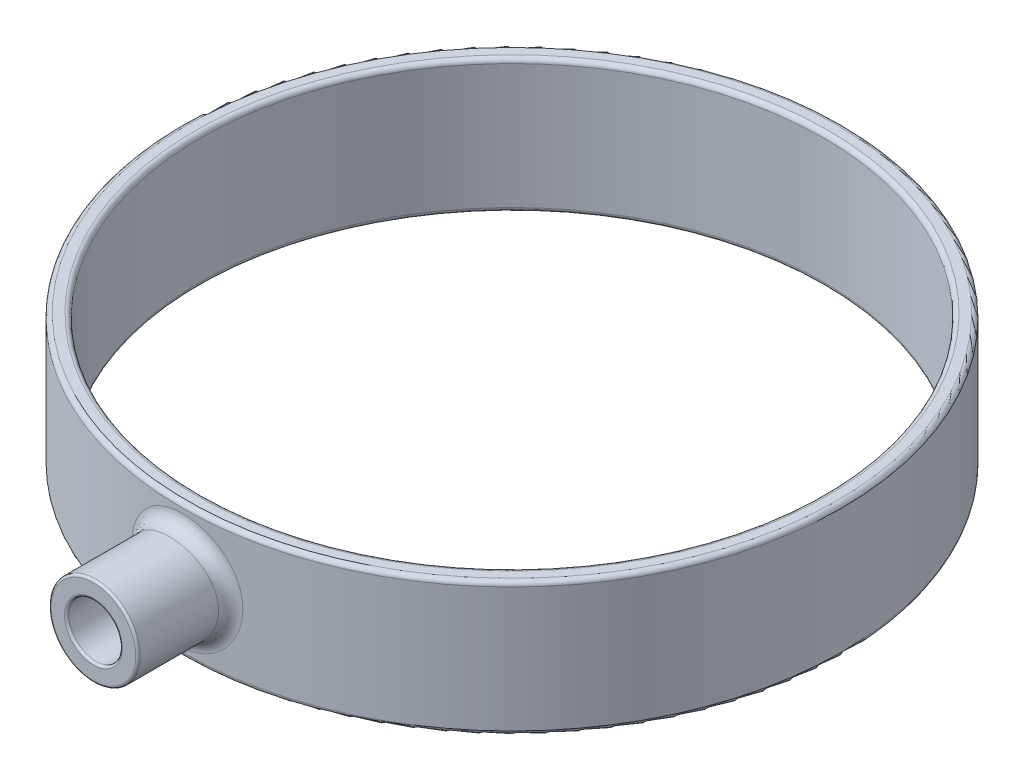
ISO-10303-21;
HEADER;
FILE_DESCRIPTION(('STEP AP214'),'2;1');
FILE_NAME('part.step','',(''),(''),'','','');
FILE_SCHEMA(('AUTOMOTIVE_DESIGN { 1 0 10303 214 1 1 1 1 }'));
ENDSEC;
DATA;
#1=APPLICATION_CONTEXT('core data for automotive mechanical design processes');
#2=APPLICATION_PROTOCOL_DEFINITION('international standard','automotive_design',2000,#1);
#3=PRODUCT_CONTEXT('',#1,'mechanical');
#4=PRODUCT('Part','Part','',(#3));
#5=PRODUCT_RELATED_PRODUCT_CATEGORY('part','',(#4));
#6=PRODUCT_DEFINITION_FORMATION('','',#4);
#7=PRODUCT_DEFINITION_CONTEXT('part definition',#1,'design');
#8=PRODUCT_DEFINITION('design','',#6,#7);
#9=PRODUCT_DEFINITION_SHAPE('','',#8);
#10=(LENGTH_UNIT() NAMED_UNIT(*) SI_UNIT(.MILLI.,.METRE.));
#11=(NAMED_UNIT(*) PLANE_ANGLE_UNIT() SI_UNIT($,.RADIAN.));
#12=(NAMED_UNIT(*) SI_UNIT($,.STERADIAN.) SOLID_ANGLE_UNIT());
#13=UNCERTAINTY_MEASURE_WITH_UNIT(LENGTH_MEASURE(1.E-05),#10,'distance_accuracy_value','');
#14=(GEOMETRIC_REPRESENTATION_CONTEXT(3) GLOBAL_UNCERTAINTY_ASSIGNED_CONTEXT((#13)) GLOBAL_UNIT_ASSIGNED_CONTEXT((#10,
#11,#12)) REPRESENTATION_CONTEXT('',''));
#15=CARTESIAN_POINT('',(0.,0.,0.));
#16=DIRECTION('',(0.,0.,1.));
#17=DIRECTION('',(1.,0.,0.));
#18=AXIS2_PLACEMENT_3D('',#15,#16,#17);
#19=CARTESIAN_POINT('',(0.,15.2591186440678,0.));
#20=DIRECTION('',(0.,1.,0.));
#21=DIRECTION('',(0.,0.,1.));
#22=AXIS2_PLACEMENT_3D('',#19,#20,#21);
#23=CYLINDRICAL_SURFACE('',#22,35.);
#24=CARTESIAN_POINT('',(0.,-6.99999999999999,0.));
#25=DIRECTION('',(0.,1.,0.));
#26=DIRECTION('',(0.,0.,1.));
#27=AXIS2_PLACEMENT_3D('',#24,#25,#26);
#28=CIRCLE('',#27,35.);
#29=CARTESIAN_POINT('',(0.,-6.99999999999999,35.));
#30=VERTEX_POINT('',#29);
#31=EDGE_CURVE('E52',#30,#30,#28,.F.);
#32=ORIENTED_EDGE('',*,*,#31,.T.);
#33=EDGE_LOOP('',(#32));
#34=FACE_BOUND('',#33,.T.);
#35=CARTESIAN_POINT('',(0.,7.00000000000001,0.));
#36=DIRECTION('',(0.,-1.,0.));
#37=DIRECTION('',(0.,0.,-1.));
#38=AXIS2_PLACEMENT_3D('',#35,#36,#37);
#39=CIRCLE('',#38,35.);
#40=CARTESIAN_POINT('',(0.,7.00000000000001,-35.));
#41=VERTEX_POINT('',#40);
#42=EDGE_CURVE('E55',#41,#41,#39,.F.);
#43=ORIENTED_EDGE('',*,*,#42,.T.);
#44=EDGE_LOOP('',(#43));
#45=FACE_BOUND('',#44,.T.);
#46=ADVANCED_FACE('F32',(#34,#45),#23,.F.);
#47=CARTESIAN_POINT('',(35.,-7.49999999999999,0.));
#48=DIRECTION('',(0.,1.,0.));
#49=DIRECTION('',(0.,0.,1.));
#50=AXIS2_PLACEMENT_3D('',#47,#48,#49);
#51=PLANE('',#50);
#52=CARTESIAN_POINT('',(0.,-7.49999999999999,0.));
#53=DIRECTION('',(0.,1.,0.));
#54=DIRECTION('',(0.,0.,1.));
#55=AXIS2_PLACEMENT_3D('',#52,#53,#54);
#56=CIRCLE('',#55,35.5);
#57=CARTESIAN_POINT('',(0.,-7.49999999999999,35.5));
#58=VERTEX_POINT('',#57);
#59=EDGE_CURVE('E58',#58,#58,#56,.T.);
#60=ORIENTED_EDGE('',*,*,#59,.T.);
#61=EDGE_LOOP('',(#60));
#62=FACE_BOUND('',#61,.T.);
#63=CARTESIAN_POINT('',(0.,-7.49999999999999,0.));
#64=DIRECTION('',(0.,1.,0.));
#65=DIRECTION('',(0.,0.,1.));
#66=AXIS2_PLACEMENT_3D('',#63,#64,#65);
#67=CIRCLE('',#66,36.5);
#68=CARTESIAN_POINT('',(0.,-7.49999999999999,36.5));
#69=VERTEX_POINT('',#68);
#70=EDGE_CURVE('E61',#69,#69,#67,.F.);
#71=ORIENTED_EDGE('',*,*,#70,.T.);
#72=EDGE_LOOP('',(#71));
#73=FACE_BOUND('',#72,.T.);
#74=ADVANCED_FACE('F100',(#62,#73),#51,.F.);
#75=CARTESIAN_POINT('',(0.,15.2591186440678,0.));
#76=DIRECTION('',(0.,1.,0.));
#77=DIRECTION('',(0.,0.,1.));
#78=AXIS2_PLACEMENT_3D('',#75,#76,#77);
#79=CYLINDRICAL_SURFACE('',#78,37.);
#80=CARTESIAN_POINT('',(0.,-6.99999999999999,0.));
#81=DIRECTION('',(0.,1.,0.));
#82=DIRECTION('',(0.,0.,1.));
#83=AXIS2_PLACEMENT_3D('',#80,#81,#82);
#84=CIRCLE('',#83,37.);
#85=CARTESIAN_POINT('',(0.,-6.99999999999999,37.));
#86=VERTEX_POINT('',#85);
#87=EDGE_CURVE('E43',#86,#86,#84,.T.);
#88=ORIENTED_EDGE('',*,*,#87,.T.);
#89=EDGE_LOOP('',(#88));
#90=FACE_BOUND('',#89,.T.);
#91=CARTESIAN_POINT('',(0.,7.00000000000001,0.));
#92=DIRECTION('',(0.,-1.,0.));
#93=DIRECTION('',(0.,0.,-1.));
#94=AXIS2_PLACEMENT_3D('',#91,#92,#93);
#95=CIRCLE('',#94,37.);
#96=CARTESIAN_POINT('',(0.,7.00000000000001,-37.));
#97=VERTEX_POINT('',#96);
#98=EDGE_CURVE('E47',#97,#97,#95,.T.);
#99=ORIENTED_EDGE('',*,*,#98,.T.);
#100=EDGE_LOOP('',(#99));
#101=FACE_BOUND('',#100,.T.);
#102=CARTESIAN_POINT('',(4.86471091963291,-1.15524355371684,37.9770384990668));
#103=CARTESIAN_POINT('',(4.85337000618559,-1.20299994699709,36.7013000592004));
#104=CARTESIAN_POINT('',(6.07772974634657,-1.5018166198319,36.4974136224798));
#105=CARTESIAN_POINT('',(4.92945723035187,-0.882597477970086,37.9630230238699));
#106=CARTESIAN_POINT('',(4.92322775678545,-0.920703679792843,36.6924520052298));
#107=CARTESIAN_POINT('',(6.15862059165748,-1.14737672136071,36.4839442046073));
#108=CARTESIAN_POINT('',(4.97125706409363,-0.604355888256829,37.9537205270873));
#109=CARTESIAN_POINT('',(4.96876757215891,-0.630508024680443,36.6864982257155));
#110=CARTESIAN_POINT('',(6.21084324091832,-0.785662654733737,36.4750041417682));
#111=CARTESIAN_POINT('',(5.00765560028706,-0.0447219485892453,37.9456338891884));
#112=CARTESIAN_POINT('',(5.00830143792854,-0.0469014298190285,36.6813398685768));
#113=CARTESIAN_POINT('',(6.25631777575035,-0.0581385331662,36.4672325676991));
#114=CARTESIAN_POINT('',(5.00225770411468,0.236670172857591,37.9468489901054));
#115=CARTESIAN_POINT('',(5.00240722003136,0.247301969050445,36.6821206858632));
#116=CARTESIAN_POINT('',(6.24957391083279,0.307671224714626,36.4684003280334));
#117=CARTESIAN_POINT('',(4.94475425601912,0.791416363644054,37.9595819108153));
#118=CARTESIAN_POINT('',(4.93999023934826,0.82540992663859,36.690233759774));
#119=CARTESIAN_POINT('',(6.17773194065881,1.02884127273751,36.4806371611618));
#120=CARTESIAN_POINT('',(4.89315211423498,1.06482435243964,37.9709886861695));
#121=CARTESIAN_POINT('',(4.88384765890611,1.11014961979795,36.6975168664247));
#122=CARTESIAN_POINT('',(6.11326277118969,1.38427165817231,36.4915995159432));
#123=CARTESIAN_POINT('',(4.74551035439131,1.59904235149792,38.002641964539));
#124=CARTESIAN_POINT('',(4.7245379937294,1.66321910105624,36.7174742781041));
#125=CARTESIAN_POINT('',(5.92880644263465,2.07875505694796,36.522019549573));
#126=CARTESIAN_POINT('',(4.64946929726731,1.85985195348523,38.0228887538191));
#127=CARTESIAN_POINT('',(4.62098510456638,1.93213261240496,36.7301948125226));
#128=CARTESIAN_POINT('',(5.80881748565262,2.41780753953081,36.5414775035331));
#129=CARTESIAN_POINT('',(4.4152210829074,2.36287110267105,38.0700481431573));
#130=CARTESIAN_POINT('',(4.37102435451885,2.44654090257071,36.7593460207483));
#131=CARTESIAN_POINT('',(5.51615932698135,3.07173243347235,36.586799514341));
#132=CARTESIAN_POINT('',(4.27682056712336,2.60498884477747,38.0969912014486));
#133=CARTESIAN_POINT('',(4.22392170895632,2.69223267878121,36.7758434984908));
#134=CARTESIAN_POINT('',(5.34324855266376,3.38648549821133,36.612692842733));
#135=CARTESIAN_POINT('',(3.96191401154341,3.06274902358894,38.1544894193196));
#136=CARTESIAN_POINT('',(3.89324933316868,3.15213068929333,36.8103820165402));
#137=CARTESIAN_POINT('',(4.94981984294872,3.98157373066618,36.6679508702046));
#138=CARTESIAN_POINT('',(3.78540478620487,3.27838924464794,38.1850448807668));
#139=CARTESIAN_POINT('',(3.70920426083321,3.36633967239603,36.8284545628467));
#140=CARTESIAN_POINT('',(4.72929792769153,4.2619060180422,36.6973158593909));
#141=CARTESIAN_POINT('',(3.39661008962417,3.67996362844022,38.2468041474585));
#142=CARTESIAN_POINT('',(3.30905456269161,3.76095318999368,36.8642393087673));
#143=CARTESIAN_POINT('',(4.24355702107162,4.78395271697241,36.7566689209821));
#144=CARTESIAN_POINT('',(3.18389654358005,3.86548328422251,38.2780112493025));
#145=CARTESIAN_POINT('',(3.09228469961183,3.94058567772731,36.881940548127));
#146=CARTESIAN_POINT('',(3.97780321417637,5.02512826949033,36.7866601615421));
#147=CARTESIAN_POINT('',(2.73015019465978,4.19826591685627,38.337200337788));
#148=CARTESIAN_POINT('',(2.63589524490729,4.25941238457704,36.9148409897236));
#149=CARTESIAN_POINT('',(3.41091491850603,5.45774569191384,36.843543181608));
#150=CARTESIAN_POINT('',(2.48911716645012,4.34552858927321,38.365182298764));
#151=CARTESIAN_POINT('',(2.3962619908469,4.39812910606802,36.930005346586));
#152=CARTESIAN_POINT('',(3.10978014821036,5.64918716605454,36.8704349364484));
#153=CARTESIAN_POINT('',(1.98509654015797,4.59770414817214,38.4148189100136));
#154=CARTESIAN_POINT('',(1.90080196527733,4.63368460079975,36.9564625044231));
#155=CARTESIAN_POINT('',(2.48008165147404,5.97701539262441,36.9181376538055));
#156=CARTESIAN_POINT('',(1.72208334709135,4.70256680852917,38.4364660478619));
#157=CARTESIAN_POINT('',(1.64528756630519,4.72994773261604,36.9676978193883));
#158=CARTESIAN_POINT('',(2.15148594792332,6.11333685109111,36.9389413965884));
#159=CARTESIAN_POINT('',(1.18183306264162,4.8665120127487,38.4709372724457));
#160=CARTESIAN_POINT('',(1.12448096619732,4.87981942618282,36.9854204833059));
#161=CARTESIAN_POINT('',(1.47652390423165,6.32646561657659,36.9720695864255));
#162=CARTESIAN_POINT('',(0.90459716321574,4.92559838630713,38.483762097256));
#163=CARTESIAN_POINT('',(0.859824927558605,4.93301022537734,36.9918599589387));
#164=CARTESIAN_POINT('',(1.13015905326325,6.40327790220007,36.9843947427982));
#165=CARTESIAN_POINT('',(0.347322412949161,4.9957275675175,38.4990364871516));
#166=CARTESIAN_POINT('',(0.32922274120454,4.99624476121676,36.9995332973664));
#167=CARTESIAN_POINT('',(0.433927482153149,6.49444583777197,36.9990740266323));
#168=CARTESIAN_POINT('',(0.0673567137420761,5.00733638634058,38.5016082760479));
#169=CARTESIAN_POINT('',(0.0641290562097716,5.00660196299893,37.0008049091509));
#170=CARTESIAN_POINT('',(0.0841521540524478,6.50953730224282,37.001545615939));
#171=CARTESIAN_POINT('',(-0.490524166492074,4.98370606714712,38.496426572443));
#172=CARTESIAN_POINT('',(-0.4656970954445,4.9853548513288,36.9982142200999));
#173=CARTESIAN_POINT('',(-0.612836685929706,6.47881788729141,36.9965657968935));
#174=CARTESIAN_POINT('',(-0.768439430469086,4.94846883484401,38.4886734999606));
#175=CARTESIAN_POINT('',(-0.729589027527958,4.95381934501874,36.9943603236358));
#176=CARTESIAN_POINT('',(-0.960050301444727,6.4330094852966,36.9891147921958));
#177=CARTESIAN_POINT('',(-1.3124867651498,4.8326225804137,38.4637915359862));
#178=CARTESIAN_POINT('',(-1.25024670663373,4.84876821568362,36.981740519611));
#179=CARTESIAN_POINT('',(-1.63975619230252,6.28240935453842,36.9652022553377));
#180=CARTESIAN_POINT('',(-1.57868337290135,4.75230821708441,38.4467235537254));
#181=CARTESIAN_POINT('',(-1.50632878908045,4.77583202384171,36.9730428864624));
#182=CARTESIAN_POINT('',(-1.97232909704794,6.17800068221233,36.9487992593223));
#183=CARTESIAN_POINT('',(-2.09382206595468,4.54891233734191,38.4051239807591));
#184=CARTESIAN_POINT('',(-2.00727285622883,4.58809888698969,36.951307570593));
#185=CARTESIAN_POINT('',(-2.61591795771994,5.91358603854698,36.9088204489401));
#186=CARTESIAN_POINT('',(-2.34276364764969,4.4258295733161,38.3805921723262));
#187=CARTESIAN_POINT('',(-2.25166393775665,4.4737628382773,36.9383201221727));
#188=CARTESIAN_POINT('',(-2.92693328446505,5.75357844531135,36.8852444253287));
#189=CARTESIAN_POINT('',(-2.81874244260166,4.13914916772287,38.3264901226893));
#190=CARTESIAN_POINT('',(-2.72444126514171,4.20288811259775,36.9089276041702));
#191=CARTESIAN_POINT('',(-3.52159770101781,5.38089391803931,36.8332502478032));
#192=CARTESIAN_POINT('',(-3.04556866224729,3.97520604898105,38.2968776258939));
#193=CARTESIAN_POINT('',(-2.95252072556793,4.04648474105914,36.8925381316393));
#194=CARTESIAN_POINT('',(-3.80498318582009,5.16776786367619,36.8047914846184));
#195=CARTESIAN_POINT('',(-3.46873662897258,3.61187682765904,38.2360098604349));
#196=CARTESIAN_POINT('',(-3.38268520085637,3.69429919538719,36.8580483603847));
#197=CARTESIAN_POINT('',(-4.3336683598331,4.69543987595795,36.746295190533));
#198=CARTESIAN_POINT('',(-3.66507052154777,3.41248162126748,38.2047541712682));
#199=CARTESIAN_POINT('',(-3.58491848188572,3.49890257382598,36.8399678886891));
#200=CARTESIAN_POINT('',(-4.57895823601359,4.43622610764804,36.7162572555126));
#201=CARTESIAN_POINT('',(-4.0238581121251,2.98129555526313,38.1437091138023));
#202=CARTESIAN_POINT('',(-3.95767605725251,3.07076546307586,36.8039904544421));
#203=CARTESIAN_POINT('',(-5.02720974527639,3.87568422184174,36.6575905768928));
#204=CARTESIAN_POINT('',(-4.18590884197933,2.74916769261151,38.1139400257427));
#205=CARTESIAN_POINT('',(-4.12824786235943,2.83777500621793,36.7860812853365));
#206=CARTESIAN_POINT('',(-5.22966792984137,3.57391800039488,36.6289813233931));
#207=CARTESIAN_POINT('',(-4.4685890022098,2.26078912137746,38.0596671947167));
#208=CARTESIAN_POINT('',(-4.42748091127424,2.3427212555236,36.7530079129246));
#209=CARTESIAN_POINT('',(-5.5828345716001,2.93902585779078,36.576823018347));
#210=CARTESIAN_POINT('',(-4.58925741924721,2.00456140916027,38.0351585040726));
#211=CARTESIAN_POINT('',(-4.55670883556228,2.08052870380113,36.7377965767624));
#212=CARTESIAN_POINT('',(-5.7335917368043,2.60592983190836,36.5532692118895));
#213=CARTESIAN_POINT('',(-4.7583566577734,1.54906051194178,37.9999171871221));
#214=CARTESIAN_POINT('',(-4.73838577055043,1.61127801801397,36.7157605947015));
#215=CARTESIAN_POINT('',(-5.94485598020917,2.01377866552431,36.519400932946));
#216=CARTESIAN_POINT('',(-4.81754605807879,1.35379435811287,37.9872488830442));
#217=CARTESIAN_POINT('',(-4.80231676470593,1.40923569439618,36.7077675168164));
#218=CARTESIAN_POINT('',(-6.01880429586584,1.75993266554677,36.5072261988585));
#219=CARTESIAN_POINT('',(-4.91171739081881,0.957359626806678,37.9668624044574));
#220=CARTESIAN_POINT('',(-4.90411625672732,0.998004434169409,36.6948714917423));
#221=CARTESIAN_POINT('',(-6.13645731157502,1.24456751484873,36.4876339986596));
#222=CARTESIAN_POINT('',(-4.94669981717313,0.756191169847438,37.9591441289482));
#223=CARTESIAN_POINT('',(-4.94212104158613,0.788566432431072,36.6899518467281));
#224=CARTESIAN_POINT('',(-6.18016262870642,0.983048520801691,36.480216435483));
#225=CARTESIAN_POINT('',(-5.00001309035365,0.277398095690273,37.9473548765447));
#226=CARTESIAN_POINT('',(-4.99995466813792,0.289799800022275,36.6824458501982));
#227=CARTESIAN_POINT('',(-6.24676960122445,0.360617524397326,36.4688865049077));
#228=CARTESIAN_POINT('',(-5.00771396836284,-0.00151226940761473,37.9456195846297));
#229=CARTESIAN_POINT('',(-5.00836796999471,-0.00178071623625106,36.6813301441002));
#230=CARTESIAN_POINT('',(-6.25639069814282,-0.00196595022995377,36.4672188216291));
#231=CARTESIAN_POINT('',(-4.97668714736008,-0.556819644280988,37.9525149834268));
#232=CARTESIAN_POINT('',(-4.97466871717278,-0.58094021566909,36.6857288723265));
#233=CARTESIAN_POINT('',(-6.21762731916295,-0.72386553756523,36.4738455684511));
#234=CARTESIAN_POINT('',(-4.93792031648918,-0.833214337919557,37.9611544110143));
#235=CARTESIAN_POINT('',(-4.93242275616096,-0.869292612760622,36.6912607810904));
#236=CARTESIAN_POINT('',(-6.16919395385136,-1.08317863929523,36.4821483950295));
#237=CARTESIAN_POINT('',(-4.81515548019795,-1.37529478981959,37.9877955239181));
#238=CARTESIAN_POINT('',(-4.79966155317507,-1.43187647208948,36.7081242149874));
#239=CARTESIAN_POINT('',(-6.01581762590581,-1.78788322676565,36.507751542438));
#240=CARTESIAN_POINT('',(-4.73118853221662,-1.64098776676063,38.0057907804636));
#241=CARTESIAN_POINT('',(-4.70884610874487,-1.70676636990218,36.7194929414676));
#242=CARTESIAN_POINT('',(-5.91091346490346,-2.13328409678953,36.525045684969));
#243=CARTESIAN_POINT('',(-4.52055571491639,-2.15443426278992,38.0490896417671));
#244=CARTESIAN_POINT('',(-4.48327066383743,-2.233938732107,36.7464307703508));
#245=CARTESIAN_POINT('',(-5.64775921783887,-2.80076454162756,36.5666575776844));
#246=CARTESIAN_POINT('',(-4.39389406855062,-2.40218955316032,38.0743925236888));
#247=CARTESIAN_POINT('',(-4.34803364863304,-2.48662360583093,36.7620508824111));
#248=CARTESIAN_POINT('',(-5.48951440772585,-3.12284641910852,36.590974633195));
#249=CARTESIAN_POINT('',(-4.10040330686644,-2.87482818265822,38.1296840171741));
#250=CARTESIAN_POINT('',(-4.03830524843744,-2.96409342767591,36.7955608506092));
#251=CARTESIAN_POINT('',(-5.12284153402893,-3.73727663745559,36.644111912569));
#252=CARTESIAN_POINT('',(-3.93328705821417,-3.09953089688654,38.1597055605837));
#253=CARTESIAN_POINT('',(-3.86304068779189,-3.1887421951214,36.8135046569002));
#254=CARTESIAN_POINT('',(-4.91405474022754,-4.02939016595278,36.6729637852166));
#255=CARTESIAN_POINT('',(-3.5640060756245,-3.51791541322736,38.2209602308402));
#256=CARTESIAN_POINT('',(-3.48074585250328,-3.60253823054198,36.8493739626674));
#257=CARTESIAN_POINT('',(-4.45269330483446,-4.57329003719557,36.7318319098748));
#258=CARTESIAN_POINT('',(-3.36183832720166,-3.71159454450329,38.2521934617146));
#259=CARTESIAN_POINT('',(-3.27334855436552,-3.79147477266841,36.8673078095416));
#260=CARTESIAN_POINT('',(-4.20011489709344,-4.82507290785364,36.76184826186));
#261=CARTESIAN_POINT('',(-2.92565276019271,-4.064488283097,38.3127463338812));
#262=CARTESIAN_POINT('',(-2.83171014877678,-4.13204538707337,36.901371668317));
#263=CARTESIAN_POINT('',(-3.65516617572922,-5.28383476802674,36.8200419313105));
#264=CARTESIAN_POINT('',(-2.69132371126091,-4.22332092446939,38.3420425233344));
#265=CARTESIAN_POINT('',(-2.59712581557742,-4.28281520179118,36.9174527461847));
#266=CARTESIAN_POINT('',(-3.3624070262711,-5.49031720181281,36.8481967106408));
#267=CARTESIAN_POINT('',(-2.19896309475519,-4.49935612764256,38.39506590877));
#268=CARTESIAN_POINT('',(-2.11011694625105,-4.54243133658752,36.9460390198583));
#269=CARTESIAN_POINT('',(-2.74727597031962,-5.84916296593771,36.8991542498524));
#270=CARTESIAN_POINT('',(-1.94093231914598,-4.61656007977956,38.4187932907333));
#271=CARTESIAN_POINT('',(-1.85792776450258,-4.65074903105855,36.9584941632109));
#272=CARTESIAN_POINT('',(-2.42490505326789,-6.00152810371363,36.9219571884685));
#273=CARTESIAN_POINT('',(-1.40974701199838,-4.80537973929687,38.4579020463906));
#274=CARTESIAN_POINT('',(-1.34338111408744,-4.82428278346825,36.9787821551331));
#275=CARTESIAN_POINT('',(-1.7612683448631,-6.24699366108573,36.9595422264297));
#276=CARTESIAN_POINT('',(-1.13667198260595,-4.87721400051798,38.4733233780341));
#277=CARTESIAN_POINT('',(-1.08162591200339,-4.88924783853191,36.9865860876097));
#278=CARTESIAN_POINT('',(-1.42010187956776,-6.34037820067492,36.9743627269219));
#279=CARTESIAN_POINT('',(-0.582121924722694,-4.97396600528119,38.4942497505626));
#280=CARTESIAN_POINT('',(-0.552255838057005,-4.97673949769498,36.9971499035569));
#281=CARTESIAN_POINT('',(-0.727274404652167,-6.46615580686725,36.9944737862198));
#282=CARTESIAN_POINT('',(-0.300647632325699,-4.99888784793403,38.4997556578353));
#283=CARTESIAN_POINT('',(-0.285423617043764,-4.9990012370912,36.9998780568097));
#284=CARTESIAN_POINT('',(-0.375614314671224,-6.49855420231433,36.9997651776578));
#285=CARTESIAN_POINT('',(0.258994542412301,-5.00102599699898,38.5002254298168));
#286=CARTESIAN_POINT('',(0.245899235724886,-5.00092141312309,37.0001125061714));
#287=CARTESIAN_POINT('',(0.323574999740467,-6.50133379609858,37.000216646839));
#288=CARTESIAN_POINT('',(0.537160303878879,-4.97882797385369,38.4953187170858));
#289=CARTESIAN_POINT('',(0.509537473094439,-4.98109642745897,36.9976821203501));
#290=CARTESIAN_POINT('',(0.671101574455368,-6.47247636601107,36.9955011047058));
#291=CARTESIAN_POINT('',(1.08574025781014,-4.88860298698219,38.475772398165));
#292=CARTESIAN_POINT('',(1.03290041018059,-4.89956146712813,36.9878260771909));
#293=CARTESIAN_POINT('',(1.35647029612162,-6.35518388307807,36.9767163306893));
#294=CARTESIAN_POINT('',(1.35615447540909,-4.82057617187271,38.4611328235376));
#295=CARTESIAN_POINT('',(1.29186305248704,-4.83809704376404,36.9804298999234));
#296=CARTESIAN_POINT('',(1.69431247447448,-6.26674902343431,36.9626471291388));
#297=CARTESIAN_POINT('',(1.88143082740101,-4.6408212641414,38.423751841014));
#298=CARTESIAN_POINT('',(1.80004808917187,-4.67312331184798,36.9610836129965));
#299=CARTESIAN_POINT('',(2.35056682591943,-6.03306764338404,36.9267225484822));
#300=CARTESIAN_POINT('',(2.13630522384189,-4.52912815708929,38.4010169204317));
#301=CARTESIAN_POINT('',(2.04872665306592,-4.57007973891831,36.9491857103552));
#302=CARTESIAN_POINT('',(2.66899431860904,-5.88786660421816,36.9048734039379));
#303=CARTESIAN_POINT('',(2.62379957311588,-4.26526791791459,38.3499242462802));
#304=CARTESIAN_POINT('',(2.52996564030055,-4.32246018186061,36.9217408701999));
#305=CARTESIAN_POINT('',(3.27804570043381,-5.54484829329123,36.8557713534861));
#306=CARTESIAN_POINT('',(2.85641781235288,-4.11309767268943,38.3215660602674));
#307=CARTESIAN_POINT('',(2.7622740312699,-4.17838313742173,36.9062421610086));
#308=CARTESIAN_POINT('',(3.56866744868656,-5.34702697449684,36.8285180319835));
#309=CARTESIAN_POINT('',(3.29578252624482,-3.7704574810788,38.2619455013356));
#310=CARTESIAN_POINT('',(3.20599203719586,-3.84864038346811,36.8728557521853));
#311=CARTESIAN_POINT('',(4.11758803927569,-4.90159472540185,36.7712203518943));
#312=CARTESIAN_POINT('',(3.50218670815428,-3.57955168645993,38.2306524796128));
#313=CARTESIAN_POINT('',(3.41721125132202,-3.66292700808572,36.8549692597548));
#314=CARTESIAN_POINT('',(4.3754592379478,-4.65341719239785,36.7411465386091));
#315=CARTESIAN_POINT('',(3.88019448009143,-3.16585030245026,38.1689270819526));
#316=CARTESIAN_POINT('',(3.8076885575304,-3.25474488408679,36.8189655750231));
#317=CARTESIAN_POINT('',(4.84772349329174,-4.1156053931854,36.681826026659));
#318=CARTESIAN_POINT('',(4.05179638673158,-2.94305317136286,38.138494747708));
#319=CARTESIAN_POINT('',(3.98729201685128,-3.03251206336104,36.8008435731753));
#320=CARTESIAN_POINT('',(5.06211444682224,-3.82596912277137,36.6525793680624));
#321=CARTESIAN_POINT('',(4.35641152054756,-2.47008298468829,38.0817155043682));
#322=CARTESIAN_POINT('',(4.30819417868006,-2.55563098321936,36.766538503922));
#323=CARTESIAN_POINT('',(5.44268556201206,-3.21110788009512,36.5980123027631));
#324=CARTESIAN_POINT('',(4.48916364749527,-2.21973958727734,38.0553967682915));
#325=CARTESIAN_POINT('',(4.44975229763788,-2.30070188138964,36.7503302302093));
#326=CARTESIAN_POINT('',(5.60853951793102,-2.88566146346199,36.5727189714234));
#327=CARTESIAN_POINT('',(4.71063733502765,-1.69991114764923,38.0101314870587));
#328=CARTESIAN_POINT('',(4.68669699799592,-1.76757218520119,36.7222198869596));
#329=CARTESIAN_POINT('',(5.88523781328959,-2.20988449194548,36.5292172727205));
#330=CARTESIAN_POINT('',(4.79936194686656,-1.43042743340023,37.9911844310401));
#331=CARTESIAN_POINT('',(4.78260171731052,-1.48897571367038,36.7102634402712));
#332=CARTESIAN_POINT('',(5.99608596481567,-1.8595556634207,36.5110084143985));
#333=CARTESIAN_POINT('',(4.86471091963291,-1.15524355371684,37.9770384990668));
#334=CARTESIAN_POINT('',(4.85337000618559,-1.20299994699709,36.7013000592004));
#335=CARTESIAN_POINT('',(6.07772974634657,-1.5018166198319,36.4974136224798));
#336=(BOUNDED_SURFACE() B_SPLINE_SURFACE(3,2,((#102,#103,#104),(#105,#106,#107),(#108,#109,
#110),(#111,#112,#113),(#114,#115,#116),(#117,#118,#119),(#120,#121,#122),(#123,#124,#125),
(#126,#127,#128),(#129,#130,#131),(#132,#133,#134),(#135,#136,#137),(#138,#139,#140),(#141,#142,
#143),(#144,#145,#146),(#147,#148,#149),(#150,#151,#152),(#153,#154,#155),(#156,#157,#158),
(#159,#160,#161),(#162,#163,#164),(#165,#166,#167),(#168,#169,#170),(#171,#172,#173),(#174,#175,
#176),(#177,#178,#179),(#180,#181,#182),(#183,#184,#185),(#186,#187,#188),(#189,#190,#191),
(#192,#193,#194),(#195,#196,#197),(#198,#199,#200),(#201,#202,#203),(#204,#205,#206),(#207,#208,
#209),(#210,#211,#212),(#213,#214,#215),(#216,#217,#218),(#219,#220,#221),(#222,#223,#224),
(#225,#226,#227),(#228,#229,#230),(#231,#232,#233),(#234,#235,#236),(#237,#238,#239),(#240,#241,
#242),(#243,#244,#245),(#246,#247,#248),(#249,#250,#251),(#252,#253,#254),(#255,#256,#257),
(#258,#259,#260),(#261,#262,#263),(#264,#265,#266),(#267,#268,#269),(#270,#271,#272),(#273,#274,
#275),(#276,#277,#278),(#279,#280,#281),(#282,#283,#284),(#285,#286,#287),(#288,#289,#290),
(#291,#292,#293),(#294,#295,#296),(#297,#298,#299),(#300,#301,#302),(#303,#304,#305),(#306,#307,
#308),(#309,#310,#311),(#312,#313,#314),(#315,#316,#317),(#318,#319,#320),(#321,#322,#323),
(#324,#325,#326),(#327,#328,#329),(#330,#331,#332),(#333,#334,#335)),.UNSPECIFIED.,.T.,.F.,
.F.) B_SPLINE_SURFACE_WITH_KNOTS((4,2,2,2,2,2,2,2,2,2,2,2,2,2,2,2,2,2,2,2,2,2,2,2,2,2,2,2,2,2,2,
2,2,2,2,2,2,2,4),(3,3),(0.,1.09238027035046,2.18468181730949,3.26522528192368,4.34580374020357,
5.431390206987,6.51706745411536,7.61660866125647,8.71615861786067,9.81700728798745,
10.9177638499213,12.005358622599,13.0929091529022,14.1734320532952,15.2539864766621,
16.3440068926491,17.4343076224608,18.5367878665001,19.6382265818186,20.4329753817173,
21.2277079650638,22.3104717436045,23.3941479911568,24.4770805829071,25.5599060926901,
26.6506548977752,27.7414975555875,28.8437582520398,29.9459821311638,31.0428550721696,
32.1396321662222,33.2228568845475,34.306078090135,35.3884331882795,36.4708715545927,
37.5662418459755,38.6616651078363,39.7642897371469,40.8668379402021),(0.,1.),
.UNSPECIFIED.) GEOMETRIC_REPRESENTATION_ITEM() RATIONAL_B_SPLINE_SURFACE(((1.,0.761517684953079,
1.),(1.,0.762914254192765,1.),(1.,0.763836967900265,1.),(1.,0.764639318913393,1.),(1.,
0.764519031384491,1.),(1.,0.763254971365151,1.),(1.,0.762122230119034,1.),(1.,0.758963300267418,
1.),(1.,0.756937082728595,1.),(1.,0.752185992258298,1.),(1.,0.749457924886145,1.),(1.,
0.743590705341646,1.),(1.,0.7404515188121,1.),(1.,0.734055428814935,1.),(1.,0.730797534023054,
1.),(1.,0.724572043238127,1.),(1.,0.721604449555303,1.),(1.,0.716309050561997,1.),(1.,
0.713982005065973,1.),(1.,0.710263112503945,1.),(1.,0.708871187206021,1.),(1.,0.707212196851306,
1.),(1.,0.706931880801276,1.),(1.,0.707495442990847,1.),(1.,0.708339275499702,1.),(1.,
0.711034399626407,1.),(1.,0.712879145921086,1.),(1.,0.717345144045756,1.),(1.,0.719966418527805,
1.),(1.,0.725701971370761,1.),(1.,0.728820367434302,1.),(1.,0.735177916388101,1.),(1.,
0.738417100126418,1.),(1.,0.74469607348771,1.),(1.,0.747733231515897,1.),(1.,0.753236526876818,
1.),(1.,0.755703200950285,1.),(1.,0.759235689158839,1.),(1.,0.76050032050278,1.),(1.,
0.762531632870762,1.),(1.,0.763298324054767,1.),(1.,0.764468952525341,1.),(1.,0.764640712125912,
1.),(1.,0.763956595334406,1.),(1.,0.763099852808742,1.),(1.,0.760446278706064,1.),(1.,
0.758650092653849,1.),(1.,0.75430109846943,1.),(1.,0.751748365170691,1.),(1.,0.746128065774529,
1.),(1.,0.74305686919989,1.),(1.,0.736739734628667,1.),(1.,0.733493781619315,1.),(1.,
0.727152138335128,1.),(1.,0.72405837651846,1.),(1.,0.718422690046338,1.),(1.,0.715880746962063,
1.),(1.,0.711672935871491,1.),(1.,0.710002874714055,1.),(1.,0.70773313667548,1.),(1.,
0.707133366274771,1.),(1.,0.707082253540768,1.),(1.,0.707616812179628,1.),(1.,0.709737544252598,
1.),(1.,0.71132371427647,1.),(1.,0.715348506949485,1.),(1.,0.717786446991974,1.),(1.,
0.723223459477993,1.),(1.,0.726222575076352,1.),(1.,0.732476746416325,1.),(1.,0.735734431814407,
1.),(1.,0.742110100367619,1.),(1.,0.745228076759339,1.),(1.,0.751007325674662,1.),(1.,
0.75366546105101,1.),(1.,0.758215829863496,1.),(1.,0.760108116373848,1.),(1.,0.761517684953079,1.))) REPRESENTATION_ITEM('') SURFACE());
#337=CARTESIAN_POINT('',(6.07772974634657,-1.5018166198319,36.4974136224798));
#338=CARTESIAN_POINT('',(5.99608596481567,-1.8595556634207,36.5110084143985));
#339=CARTESIAN_POINT('',(5.88523781328959,-2.20988449194548,36.5292172727205));
#340=CARTESIAN_POINT('',(5.60853951793102,-2.88566146346199,36.5727189714234));
#341=CARTESIAN_POINT('',(5.44268556201206,-3.21110788009512,36.5980123027631));
#342=CARTESIAN_POINT('',(5.06211444682224,-3.82596912277137,36.6525793680624));
#343=CARTESIAN_POINT('',(4.84772349329174,-4.1156053931854,36.681826026659));
#344=CARTESIAN_POINT('',(4.3754592379478,-4.65341719239785,36.7411465386091));
#345=CARTESIAN_POINT('',(4.11758803927569,-4.90159472540185,36.7712203518943));
#346=CARTESIAN_POINT('',(3.56866744868656,-5.34702697449684,36.8285180319835));
#347=CARTESIAN_POINT('',(3.27804570043381,-5.54484829329123,36.8557713534861));
#348=CARTESIAN_POINT('',(2.66899431860904,-5.88786660421816,36.9048734039379));
#349=CARTESIAN_POINT('',(2.35056682591943,-6.03306764338404,36.9267225484822));
#350=CARTESIAN_POINT('',(1.69431247447448,-6.26674902343431,36.9626471291388));
#351=CARTESIAN_POINT('',(1.35647029612162,-6.35518388307807,36.9767163306893));
#352=CARTESIAN_POINT('',(0.671101574455367,-6.47247636601107,36.9955011047058));
#353=CARTESIAN_POINT('',(0.323574999740468,-6.50133379609858,37.000216646839));
#354=CARTESIAN_POINT('',(-0.375614314671223,-6.49855420231433,36.9997651776578));
#355=CARTESIAN_POINT('',(-0.727274404652167,-6.46615580686725,36.9944737862198));
#356=CARTESIAN_POINT('',(-1.42010187956776,-6.34037820067492,36.9743627269219));
#357=CARTESIAN_POINT('',(-1.7612683448631,-6.24699366108573,36.9595422264297));
#358=CARTESIAN_POINT('',(-2.42490505326789,-6.00152810371364,36.9219571884685));
#359=CARTESIAN_POINT('',(-2.74727597031962,-5.84916296593771,36.8991542498524));
#360=CARTESIAN_POINT('',(-3.3624070262711,-5.49031720181281,36.8481967106408));
#361=CARTESIAN_POINT('',(-3.65516617572922,-5.28383476802674,36.8200419313105));
#362=CARTESIAN_POINT('',(-4.20011489709344,-4.82507290785364,36.76184826186));
#363=CARTESIAN_POINT('',(-4.45269330483446,-4.57329003719557,36.7318319098748));
#364=CARTESIAN_POINT('',(-4.91405474022754,-4.02939016595278,36.6729637852166));
#365=CARTESIAN_POINT('',(-5.12284153402893,-3.73727663745559,36.644111912569));
#366=CARTESIAN_POINT('',(-5.48951440772585,-3.12284641910852,36.590974633195));
#367=CARTESIAN_POINT('',(-5.64775921783887,-2.80076454162756,36.5666575776844));
#368=CARTESIAN_POINT('',(-5.91091346490346,-2.13328409678953,36.525045684969));
#369=CARTESIAN_POINT('',(-6.01581762590581,-1.78788322676565,36.507751542438));
#370=CARTESIAN_POINT('',(-6.16919395385136,-1.08317863929523,36.4821483950295));
#371=CARTESIAN_POINT('',(-6.21762731916295,-0.723865537565228,36.4738455684511));
#372=CARTESIAN_POINT('',(-6.25639069814282,-0.00196595022995352,36.4672188216291));
#373=CARTESIAN_POINT('',(-6.24676960122445,0.360617524397325,36.4688865049077));
#374=CARTESIAN_POINT('',(-6.18016262870642,0.98304852080169,36.480216435483));
#375=CARTESIAN_POINT('',(-6.13645731157502,1.24456751484873,36.4876339986596));
#376=CARTESIAN_POINT('',(-6.01880429586584,1.75993266554677,36.5072261988585));
#377=CARTESIAN_POINT('',(-5.94485598020917,2.01377866552431,36.519400932946));
#378=CARTESIAN_POINT('',(-5.7335917368043,2.60592983190836,36.5532692118895));
#379=CARTESIAN_POINT('',(-5.5828345716001,2.93902585779078,36.576823018347));
#380=CARTESIAN_POINT('',(-5.22966792984137,3.57391800039488,36.6289813233931));
#381=CARTESIAN_POINT('',(-5.02720974527639,3.87568422184174,36.6575905768928));
#382=CARTESIAN_POINT('',(-4.57895823601359,4.43622610764804,36.7162572555126));
#383=CARTESIAN_POINT('',(-4.3336683598331,4.69543987595795,36.746295190533));
#384=CARTESIAN_POINT('',(-3.80498318582009,5.16776786367619,36.8047914846184));
#385=CARTESIAN_POINT('',(-3.52159770101781,5.38089391803931,36.8332502478032));
#386=CARTESIAN_POINT('',(-2.92693328446505,5.75357844531135,36.8852444253287));
#387=CARTESIAN_POINT('',(-2.61591795771994,5.91358603854698,36.9088204489401));
#388=CARTESIAN_POINT('',(-1.97232909704794,6.17800068221233,36.9487992593223));
#389=CARTESIAN_POINT('',(-1.63975619230252,6.28240935453842,36.9652022553377));
#390=CARTESIAN_POINT('',(-0.960050301444727,6.4330094852966,36.9891147921958));
#391=CARTESIAN_POINT('',(-0.612836685929705,6.47881788729141,36.9965657968935));
#392=CARTESIAN_POINT('',(0.0841521540524476,6.50953730224282,37.001545615939));
#393=CARTESIAN_POINT('',(0.433927482153149,6.49444583777197,36.9990740266323));
#394=CARTESIAN_POINT('',(1.13015905326325,6.40327790220007,36.9843947427982));
#395=CARTESIAN_POINT('',(1.47652390423165,6.32646561657659,36.9720695864255));
#396=CARTESIAN_POINT('',(2.15148594792332,6.11333685109111,36.9389413965884));
#397=CARTESIAN_POINT('',(2.48008165147404,5.97701539262441,36.9181376538055));
#398=CARTESIAN_POINT('',(3.10978014821036,5.64918716605454,36.8704349364484));
#399=CARTESIAN_POINT('',(3.41091491850603,5.45774569191384,36.843543181608));
#400=CARTESIAN_POINT('',(3.97780321417637,5.02512826949033,36.7866601615421));
#401=CARTESIAN_POINT('',(4.24355702107162,4.78395271697241,36.7566689209821));
#402=CARTESIAN_POINT('',(4.72929792769153,4.2619060180422,36.6973158593909));
#403=CARTESIAN_POINT('',(4.94981984294872,3.98157373066618,36.6679508702046));
#404=CARTESIAN_POINT('',(5.34324855266376,3.38648549821133,36.612692842733));
#405=CARTESIAN_POINT('',(5.51615932698135,3.07173243347235,36.586799514341));
#406=CARTESIAN_POINT('',(5.80881748565262,2.41780753953081,36.5414775035331));
#407=CARTESIAN_POINT('',(5.92880644263465,2.07875505694797,36.522019549573));
#408=CARTESIAN_POINT('',(6.11326277118969,1.38427165817231,36.4915995159432));
#409=CARTESIAN_POINT('',(6.17773194065881,1.02884127273751,36.4806371611618));
#410=CARTESIAN_POINT('',(6.24957391083279,0.307671224714626,36.4684003280334));
#411=CARTESIAN_POINT('',(6.25631777575035,-0.0581385331661994,36.4672325676991));
#412=CARTESIAN_POINT('',(6.21084324091832,-0.785662654733736,36.4750041417682));
#413=CARTESIAN_POINT('',(6.15862059165748,-1.14737672136071,36.4839442046073));
#414=CARTESIAN_POINT('',(6.07772974634657,-1.5018166198319,36.4974136224798));
#415=B_SPLINE_CURVE_WITH_KNOTS('',3,(#337,#338,#339,#340,#341,#342,#343,#344,#345,#346,#347,
#348,#349,#350,#351,#352,#353,#354,#355,#356,#357,#358,#359,#360,#361,#362,#363,#364,#365,#366,
#367,#368,#369,#370,#371,#372,#373,#374,#375,#376,#377,#378,#379,#380,#381,#382,#383,#384,#385,
#386,#387,#388,#389,#390,#391,#392,#393,#394,#395,#396,#397,#398,#399,#400,#401,#402,#403,#404,
#405,#406,#407,#408,#409,#410,#411,#412,#413,#414),.UNSPECIFIED.,.T.,.F.,(4,2,2,2,2,2,2,2,2,2,2,
2,2,2,2,2,2,2,2,2,2,2,2,2,2,2,2,2,2,2,2,2,2,2,2,2,2,2,4),(0.,1.10254820305516,2.20517283236582,
3.3005960942266,4.3959663856094,5.47840475192258,6.56075985006716,7.64398105565459,
8.72720577397992,9.82398286803252,10.9208558090383,12.0230796881624,13.1253403846146,
14.2161830424269,15.306931847512,16.389757357295,17.4726899490453,18.5563661965976,
19.6391299751383,20.4338625584848,21.2286113583835,22.3300500737021,23.4325303177413,
24.522831047553,25.6128514635401,26.6934058869069,27.7739287872999,28.8614793176031,
29.9490740902808,31.0498306522147,32.1506793223414,33.2502292789457,34.3497704860867,
35.4354477332151,36.5210341999985,37.6016126582784,38.6821561228926,39.7744576698516,
40.8668379402021),.UNSPECIFIED.);
#416=CARTESIAN_POINT('',(6.07772974634657,-1.5018166198319,36.4974136224798));
#417=VERTEX_POINT('',#416);
#418=EDGE_CURVE('E64',#417,#417,#415,.T.);
#419=ORIENTED_EDGE('',*,*,#418,.T.);
#420=EDGE_LOOP('',(#419));
#421=FACE_BOUND('',#420,.T.);
#422=ADVANCED_FACE('F106',(#90,#101,#421),#79,.T.);
#423=CARTESIAN_POINT('',(35.,7.50000000000001,0.));
#424=DIRECTION('',(0.,-1.,0.));
#425=DIRECTION('',(0.,0.,-1.));
#426=AXIS2_PLACEMENT_3D('',#423,#424,#425);
#427=PLANE('',#426);
#428=CARTESIAN_POINT('',(0.,7.50000000000001,0.));
#429=DIRECTION('',(0.,-1.,0.));
#430=DIRECTION('',(0.,0.,-1.));
#431=AXIS2_PLACEMENT_3D('',#428,#429,#430);
#432=CIRCLE('',#431,36.5);
#433=CARTESIAN_POINT('',(0.,7.50000000000001,-36.5));
#434=VERTEX_POINT('',#433);
#435=EDGE_CURVE('E10',#434,#434,#432,.F.);
#436=ORIENTED_EDGE('',*,*,#435,.T.);
#437=EDGE_LOOP('',(#436));
#438=FACE_BOUND('',#437,.T.);
#439=CARTESIAN_POINT('',(0.,7.50000000000001,0.));
#440=DIRECTION('',(0.,-1.,0.));
#441=DIRECTION('',(0.,0.,-1.));
#442=AXIS2_PLACEMENT_3D('',#439,#440,#441);
#443=CIRCLE('',#442,35.5);
#444=CARTESIAN_POINT('',(0.,7.50000000000001,-35.5));
#445=VERTEX_POINT('',#444);
#446=EDGE_CURVE('E39',#445,#445,#443,.T.);
#447=ORIENTED_EDGE('',*,*,#446,.T.);
#448=EDGE_LOOP('',(#447));
#449=FACE_BOUND('',#448,.T.);
#450=ADVANCED_FACE('F133',(#438,#449),#427,.F.);
#451=CARTESIAN_POINT('',(0.,0.,47.));
#452=DIRECTION('',(0.,0.,1.));
#453=DIRECTION('',(1.,0.,0.));
#454=AXIS2_PLACEMENT_3D('',#451,#452,#453);
#455=PLANE('',#454);
#456=CARTESIAN_POINT('',(0.,0.,47.));
#457=DIRECTION('',(0.,0.,1.));
#458=DIRECTION('',(1.,0.,0.));
#459=AXIS2_PLACEMENT_3D('',#456,#457,#458);
#460=CIRCLE('',#459,4.75);
#461=CARTESIAN_POINT('',(4.75,0.,47.));
#462=VERTEX_POINT('',#461);
#463=EDGE_CURVE('E164',#462,#462,#460,.T.);
#464=ORIENTED_EDGE('',*,*,#463,.T.);
#465=EDGE_LOOP('',(#464));
#466=FACE_BOUND('',#465,.T.);
#467=CARTESIAN_POINT('',(0.,0.,47.));
#468=DIRECTION('',(0.,0.,1.));
#469=DIRECTION('',(1.,0.,0.));
#470=AXIS2_PLACEMENT_3D('',#467,#468,#469);
#471=CIRCLE('',#470,3.25);
#472=CARTESIAN_POINT('',(3.25,0.,47.));
#473=VERTEX_POINT('',#472);
#474=EDGE_CURVE('E161',#473,#473,#471,.F.);
#475=ORIENTED_EDGE('',*,*,#474,.T.);
#476=EDGE_LOOP('',(#475));
#477=FACE_BOUND('',#476,.T.);
#478=ADVANCED_FACE('F137',(#466,#477),#455,.T.);
#479=CARTESIAN_POINT('',(0.,0.,-500000.));
#480=DIRECTION('',(0.,0.,1.));
#481=DIRECTION('',(1.,0.,0.));
#482=AXIS2_PLACEMENT_3D('',#479,#480,#481);
#483=CYLINDRICAL_SURFACE('',#482,5.);
#484=CARTESIAN_POINT('',(4.86471091963291,-1.15524355371684,37.9770384990668));
#485=CARTESIAN_POINT('',(4.92945723035187,-0.882597477970086,37.9630230238699));
#486=CARTESIAN_POINT('',(4.97125706409363,-0.604355888256829,37.9537205270873));
#487=CARTESIAN_POINT('',(5.00765560028706,-0.0447219485892454,37.9456338891884));
#488=CARTESIAN_POINT('',(5.00225770411468,0.236670172857591,37.9468489901054));
#489=CARTESIAN_POINT('',(4.94475425601912,0.791416363644054,37.9595819108153));
#490=CARTESIAN_POINT('',(4.89315211423498,1.06482435243964,37.9709886861695));
#491=CARTESIAN_POINT('',(4.74551035439131,1.59904235149792,38.002641964539));
#492=CARTESIAN_POINT('',(4.64946929726731,1.85985195348523,38.0228887538191));
#493=CARTESIAN_POINT('',(4.41522108290739,2.36287110267105,38.0700481431573));
#494=CARTESIAN_POINT('',(4.27682056712336,2.60498884477747,38.0969912014486));
#495=CARTESIAN_POINT('',(3.96191401154341,3.06274902358894,38.1544894193196));
#496=CARTESIAN_POINT('',(3.78540478620487,3.27838924464794,38.1850448807668));
#497=CARTESIAN_POINT('',(3.39661008962417,3.67996362844022,38.2468041474585));
#498=CARTESIAN_POINT('',(3.18389654358005,3.86548328422251,38.2780112493025));
#499=CARTESIAN_POINT('',(2.73015019465978,4.19826591685627,38.337200337788));
#500=CARTESIAN_POINT('',(2.48911716645012,4.34552858927321,38.365182298764));
#501=CARTESIAN_POINT('',(1.98509654015797,4.59770414817214,38.4148189100136));
#502=CARTESIAN_POINT('',(1.72208334709135,4.70256680852917,38.4364660478619));
#503=CARTESIAN_POINT('',(1.18183306264162,4.8665120127487,38.4709372724457));
#504=CARTESIAN_POINT('',(0.90459716321574,4.92559838630713,38.483762097256));
#505=CARTESIAN_POINT('',(0.347322412949161,4.9957275675175,38.4990364871516));
#506=CARTESIAN_POINT('',(0.0673567137420759,5.00733638634058,38.5016082760479));
#507=CARTESIAN_POINT('',(-0.490524166492074,4.98370606714712,38.496426572443));
#508=CARTESIAN_POINT('',(-0.768439430469085,4.94846883484401,38.4886734999606));
#509=CARTESIAN_POINT('',(-1.3124867651498,4.8326225804137,38.4637915359862));
#510=CARTESIAN_POINT('',(-1.57868337290135,4.75230821708441,38.4467235537254));
#511=CARTESIAN_POINT('',(-2.09382206595468,4.54891233734191,38.4051239807591));
#512=CARTESIAN_POINT('',(-2.34276364764969,4.4258295733161,38.3805921723262));
#513=CARTESIAN_POINT('',(-2.81874244260166,4.13914916772287,38.3264901226893));
#514=CARTESIAN_POINT('',(-3.04556866224729,3.97520604898105,38.2968776258939));
#515=CARTESIAN_POINT('',(-3.46873662897258,3.61187682765904,38.2360098604349));
#516=CARTESIAN_POINT('',(-3.66507052154777,3.41248162126748,38.2047541712682));
#517=CARTESIAN_POINT('',(-4.0238581121251,2.98129555526313,38.1437091138023));
#518=CARTESIAN_POINT('',(-4.18590884197933,2.74916769261151,38.1139400257427));
#519=CARTESIAN_POINT('',(-4.4685890022098,2.26078912137746,38.0596671947167));
#520=CARTESIAN_POINT('',(-4.58925741924721,2.00456140916027,38.0351585040726));
#521=CARTESIAN_POINT('',(-4.7583566577734,1.54906051194178,37.9999171871221));
#522=CARTESIAN_POINT('',(-4.81754605807879,1.35379435811287,37.9872488830442));
#523=CARTESIAN_POINT('',(-4.91171739081881,0.957359626806679,37.9668624044574));
#524=CARTESIAN_POINT('',(-4.94669981717313,0.756191169847438,37.9591441289482));
#525=CARTESIAN_POINT('',(-5.00001309035365,0.277398095690272,37.9473548765447));
#526=CARTESIAN_POINT('',(-5.00771396836284,-0.0015122694076145,37.9456195846297));
#527=CARTESIAN_POINT('',(-4.97668714736008,-0.556819644280987,37.9525149834268));
#528=CARTESIAN_POINT('',(-4.93792031648918,-0.833214337919557,37.9611544110143));
#529=CARTESIAN_POINT('',(-4.81515548019795,-1.37529478981959,37.9877955239181));
#530=CARTESIAN_POINT('',(-4.73118853221662,-1.64098776676063,38.0057907804636));
#531=CARTESIAN_POINT('',(-4.52055571491639,-2.15443426278992,38.0490896417671));
#532=CARTESIAN_POINT('',(-4.39389406855062,-2.40218955316032,38.0743925236888));
#533=CARTESIAN_POINT('',(-4.10040330686644,-2.87482818265822,38.1296840171741));
#534=CARTESIAN_POINT('',(-3.93328705821417,-3.09953089688654,38.1597055605837));
#535=CARTESIAN_POINT('',(-3.5640060756245,-3.51791541322736,38.2209602308402));
#536=CARTESIAN_POINT('',(-3.36183832720166,-3.71159454450329,38.2521934617146));
#537=CARTESIAN_POINT('',(-2.92565276019271,-4.064488283097,38.3127463338812));
#538=CARTESIAN_POINT('',(-2.69132371126091,-4.22332092446939,38.3420425233344));
#539=CARTESIAN_POINT('',(-2.19896309475519,-4.49935612764256,38.39506590877));
#540=CARTESIAN_POINT('',(-1.94093231914598,-4.61656007977956,38.4187932907333));
#541=CARTESIAN_POINT('',(-1.40974701199838,-4.80537973929687,38.4579020463906));
#542=CARTESIAN_POINT('',(-1.13667198260595,-4.87721400051798,38.4733233780341));
#543=CARTESIAN_POINT('',(-0.582121924722694,-4.97396600528119,38.4942497505626));
#544=CARTESIAN_POINT('',(-0.300647632325699,-4.99888784793403,38.4997556578353));
#545=CARTESIAN_POINT('',(0.258994542412302,-5.00102599699898,38.5002254298168));
#546=CARTESIAN_POINT('',(0.537160303878878,-4.97882797385369,38.4953187170858));
#547=CARTESIAN_POINT('',(1.08574025781014,-4.88860298698219,38.475772398165));
#548=CARTESIAN_POINT('',(1.35615447540909,-4.82057617187271,38.4611328235376));
#549=CARTESIAN_POINT('',(1.88143082740101,-4.6408212641414,38.423751841014));
#550=CARTESIAN_POINT('',(2.13630522384189,-4.52912815708929,38.4010169204317));
#551=CARTESIAN_POINT('',(2.62379957311588,-4.26526791791459,38.3499242462802));
#552=CARTESIAN_POINT('',(2.85641781235288,-4.11309767268943,38.3215660602674));
#553=CARTESIAN_POINT('',(3.29578252624482,-3.7704574810788,38.2619455013356));
#554=CARTESIAN_POINT('',(3.50218670815428,-3.57955168645993,38.2306524796128));
#555=CARTESIAN_POINT('',(3.88019448009143,-3.16585030245026,38.1689270819526));
#556=CARTESIAN_POINT('',(4.05179638673158,-2.94305317136286,38.138494747708));
#557=CARTESIAN_POINT('',(4.35641152054756,-2.47008298468829,38.0817155043682));
#558=CARTESIAN_POINT('',(4.48916364749527,-2.21973958727734,38.0553967682915));
#559=CARTESIAN_POINT('',(4.71063733502765,-1.69991114764923,38.0101314870587));
#560=CARTESIAN_POINT('',(4.79936194686656,-1.43042743340023,37.9911844310401));
#561=CARTESIAN_POINT('',(4.86471091963291,-1.15524355371684,37.9770384990668));
#562=B_SPLINE_CURVE_WITH_KNOTS('',3,(#484,#485,#486,#487,#488,#489,#490,#491,#492,#493,#494,
#495,#496,#497,#498,#499,#500,#501,#502,#503,#504,#505,#506,#507,#508,#509,#510,#511,#512,#513,
#514,#515,#516,#517,#518,#519,#520,#521,#522,#523,#524,#525,#526,#527,#528,#529,#530,#531,#532,
#533,#534,#535,#536,#537,#538,#539,#540,#541,#542,#543,#544,#545,#546,#547,#548,#549,#550,#551,
#552,#553,#554,#555,#556,#557,#558,#559,#560,#561),.UNSPECIFIED.,.T.,.F.,(4,2,2,2,2,2,2,2,2,2,2,
2,2,2,2,2,2,2,2,2,2,2,2,2,2,2,2,2,2,2,2,2,2,2,2,2,2,2,4),(0.,1.09238027035046,2.18468181730949,
3.26522528192368,4.34580374020357,5.431390206987,6.51706745411536,7.61660866125647,
8.71615861786067,9.81700728798745,10.9177638499213,12.005358622599,13.0929091529022,
14.1734320532952,15.2539864766621,16.3440068926491,17.4343076224608,18.5367878665001,
19.6382265818186,20.4329753817173,21.2277079650638,22.3104717436045,23.3941479911568,
24.4770805829071,25.5599060926901,26.6506548977752,27.7414975555875,28.8437582520398,
29.9459821311638,31.0428550721696,32.1396321662222,33.2228568845475,34.306078090135,
35.3884331882795,36.4708715545927,37.5662418459755,38.6616651078363,39.7642897371469,
40.8668379402021),.UNSPECIFIED.);
#563=CARTESIAN_POINT('',(4.86471091963291,-1.15524355371684,37.9770384990668));
#564=VERTEX_POINT('',#563);
#565=EDGE_CURVE('E173',#564,#564,#562,.T.);
#566=ORIENTED_EDGE('',*,*,#565,.T.);
#567=EDGE_LOOP('',(#566));
#568=FACE_BOUND('',#567,.T.);
#569=CARTESIAN_POINT('',(0.,0.,46.7499999999745));
#570=DIRECTION('',(0.,0.,1.));
#571=DIRECTION('',(1.,0.,0.));
#572=AXIS2_PLACEMENT_3D('',#569,#570,#571);
#573=CIRCLE('',#572,5.);
#574=CARTESIAN_POINT('',(5.,0.,46.7499999999745));
#575=VERTEX_POINT('',#574);
#576=EDGE_CURVE('E168',#575,#575,#573,.F.);
#577=ORIENTED_EDGE('',*,*,#576,.T.);
#578=EDGE_LOOP('',(#577));
#579=FACE_BOUND('',#578,.T.);
#580=ADVANCED_FACE('F127',(#568,#579),#483,.T.);
#581=CARTESIAN_POINT('',(0.,0.,37.));
#582=DIRECTION('',(0.,0.,1.));
#583=DIRECTION('',(1.,0.,0.));
#584=AXIS2_PLACEMENT_3D('',#581,#582,#583);
#585=CYLINDRICAL_SURFACE('',#584,3.);
#586=CARTESIAN_POINT('',(0.,0.,46.75));
#587=DIRECTION('',(0.,0.,1.));
#588=DIRECTION('',(1.,0.,0.));
#589=AXIS2_PLACEMENT_3D('',#586,#587,#588);
#590=CIRCLE('',#589,3.);
#591=CARTESIAN_POINT('',(3.,0.,46.75));
#592=VERTEX_POINT('',#591);
#593=EDGE_CURVE('E171',#592,#592,#590,.T.);
#594=ORIENTED_EDGE('',*,*,#593,.T.);
#595=EDGE_LOOP('',(#594));
#596=FACE_BOUND('',#595,.T.);
#597=CARTESIAN_POINT('',(0.,0.,37.));
#598=DIRECTION('',(0.,0.,1.));
#599=DIRECTION('',(1.,0.,0.));
#600=AXIS2_PLACEMENT_3D('',#597,#598,#599);
#601=CIRCLE('',#600,3.);
#602=CARTESIAN_POINT('',(3.,0.,37.));
#603=VERTEX_POINT('',#602);
#604=EDGE_CURVE('E159',#603,#603,#601,.T.);
#605=ORIENTED_EDGE('',*,*,#604,.F.);
#606=EDGE_LOOP('',(#605));
#607=FACE_BOUND('',#606,.T.);
#608=ADVANCED_FACE('F145',(#596,#607),#585,.F.);
#609=CARTESIAN_POINT('',(0.,0.,37.));
#610=DIRECTION('',(0.,0.,1.));
#611=DIRECTION('',(1.,0.,0.));
#612=AXIS2_PLACEMENT_3D('',#609,#610,#611);
#613=PLANE('',#612);
#614=ORIENTED_EDGE('',*,*,#604,.T.);
#615=EDGE_LOOP('',(#614));
#616=FACE_BOUND('',#615,.T.);
#617=ADVANCED_FACE('F115',(#616),#613,.T.);
#618=CARTESIAN_POINT('',(0.,0.,46.7499999999745));
#619=DIRECTION('',(0.,0.,1.));
#620=DIRECTION('',(1.,0.,0.));
#621=AXIS2_PLACEMENT_3D('',#618,#619,#620);
#622=TOROIDAL_SURFACE('',#621,4.75,0.25);
#623=ORIENTED_EDGE('',*,*,#576,.F.);
#624=EDGE_LOOP('',(#623));
#625=FACE_BOUND('',#624,.T.);
#626=ORIENTED_EDGE('',*,*,#463,.F.);
#627=EDGE_LOOP('',(#626));
#628=FACE_BOUND('',#627,.T.);
#629=ADVANCED_FACE('F111',(#625,#628),#622,.T.);
#630=CARTESIAN_POINT('',(0.,0.,46.75));
#631=DIRECTION('',(0.,0.,1.));
#632=DIRECTION('',(1.,0.,0.));
#633=AXIS2_PLACEMENT_3D('',#630,#631,#632);
#634=TOROIDAL_SURFACE('',#633,3.25,0.25);
#635=ORIENTED_EDGE('',*,*,#474,.F.);
#636=EDGE_LOOP('',(#635));
#637=FACE_BOUND('',#636,.T.);
#638=ORIENTED_EDGE('',*,*,#593,.F.);
#639=EDGE_LOOP('',(#638));
#640=FACE_BOUND('',#639,.T.);
#641=ADVANCED_FACE('F114',(#637,#640),#634,.T.);
#642=CARTESIAN_POINT('',(6.32412419552278,-1.5018166198319,37.9770384990668));
#643=DIRECTION('',(0.230877883399592,0.972222832892797,-0.0384469265199372));
#644=DIRECTION('',(-0.164262966117475,0.,-0.986416584391346));
#645=AXIS2_PLACEMENT_3D('',#642,#643,#644);
#646=CIRCLE('',#645,1.5);
#647=EDGE_CURVE('',#417,#564,#646,.T.);
#648=ORIENTED_EDGE('',*,*,#418,.F.);
#649=ORIENTED_EDGE('',*,*,#565,.F.);
#650=ORIENTED_EDGE('',*,*,#647,.T.);
#651=ORIENTED_EDGE('',*,*,#647,.F.);
#652=EDGE_LOOP('',(#648,#650,#649,#651));
#653=FACE_BOUND('',#652,.T.);
#654=ADVANCED_FACE('F86',(#653),#336,.F.);
#655=CARTESIAN_POINT('',(0.,-6.99999999999999,0.));
#656=DIRECTION('',(0.,1.,0.));
#657=DIRECTION('',(0.,0.,1.));
#658=AXIS2_PLACEMENT_3D('',#655,#656,#657);
#659=TOROIDAL_SURFACE('',#658,35.5,0.5);
#660=ORIENTED_EDGE('',*,*,#31,.F.);
#661=EDGE_LOOP('',(#660));
#662=FACE_BOUND('',#661,.T.);
#663=ORIENTED_EDGE('',*,*,#59,.F.);
#664=EDGE_LOOP('',(#663));
#665=FACE_BOUND('',#664,.T.);
#666=ADVANCED_FACE('F82',(#662,#665),#659,.T.);
#667=CARTESIAN_POINT('',(0.,-6.99999999999999,0.));
#668=DIRECTION('',(0.,1.,0.));
#669=DIRECTION('',(0.,0.,1.));
#670=AXIS2_PLACEMENT_3D('',#667,#668,#669);
#671=TOROIDAL_SURFACE('',#670,36.5,0.5);
#672=ORIENTED_EDGE('',*,*,#70,.F.);
#673=EDGE_LOOP('',(#672));
#674=FACE_BOUND('',#673,.T.);
#675=ORIENTED_EDGE('',*,*,#87,.F.);
#676=EDGE_LOOP('',(#675));
#677=FACE_BOUND('',#676,.T.);
#678=ADVANCED_FACE('F85',(#674,#677),#671,.T.);
#679=CARTESIAN_POINT('',(0.,7.00000000000001,0.));
#680=DIRECTION('',(0.,-1.,0.));
#681=DIRECTION('',(0.,0.,-1.));
#682=AXIS2_PLACEMENT_3D('',#679,#680,#681);
#683=TOROIDAL_SURFACE('',#682,36.5,0.5);
#684=ORIENTED_EDGE('',*,*,#98,.F.);
#685=EDGE_LOOP('',(#684));
#686=FACE_BOUND('',#685,.T.);
#687=ORIENTED_EDGE('',*,*,#435,.F.);
#688=EDGE_LOOP('',(#687));
#689=FACE_BOUND('',#688,.T.);
#690=ADVANCED_FACE('F89',(#686,#689),#683,.T.);
#691=CARTESIAN_POINT('',(0.,7.00000000000001,0.));
#692=DIRECTION('',(0.,-1.,0.));
#693=DIRECTION('',(0.,0.,-1.));
#694=AXIS2_PLACEMENT_3D('',#691,#692,#693);
#695=TOROIDAL_SURFACE('',#694,35.5,0.5);
#696=ORIENTED_EDGE('',*,*,#446,.F.);
#697=EDGE_LOOP('',(#696));
#698=FACE_BOUND('',#697,.T.);
#699=ORIENTED_EDGE('',*,*,#42,.F.);
#700=EDGE_LOOP('',(#699));
#701=FACE_BOUND('',#700,.T.);
#702=ADVANCED_FACE('F34',(#698,#701),#695,.T.);
#703=CLOSED_SHELL('',(#46,#74,#422,#450,#478,#580,#608,#617,#629,#641,#654,#666,#678,#690,#702));
#704=MANIFOLD_SOLID_BREP('B2',#703);
#705=ADVANCED_BREP_SHAPE_REPRESENTATION('',(#18,#704),#14);
#706=SHAPE_DEFINITION_REPRESENTATION(#9,#705);
ENDSEC;
END-ISO-10303-21;
